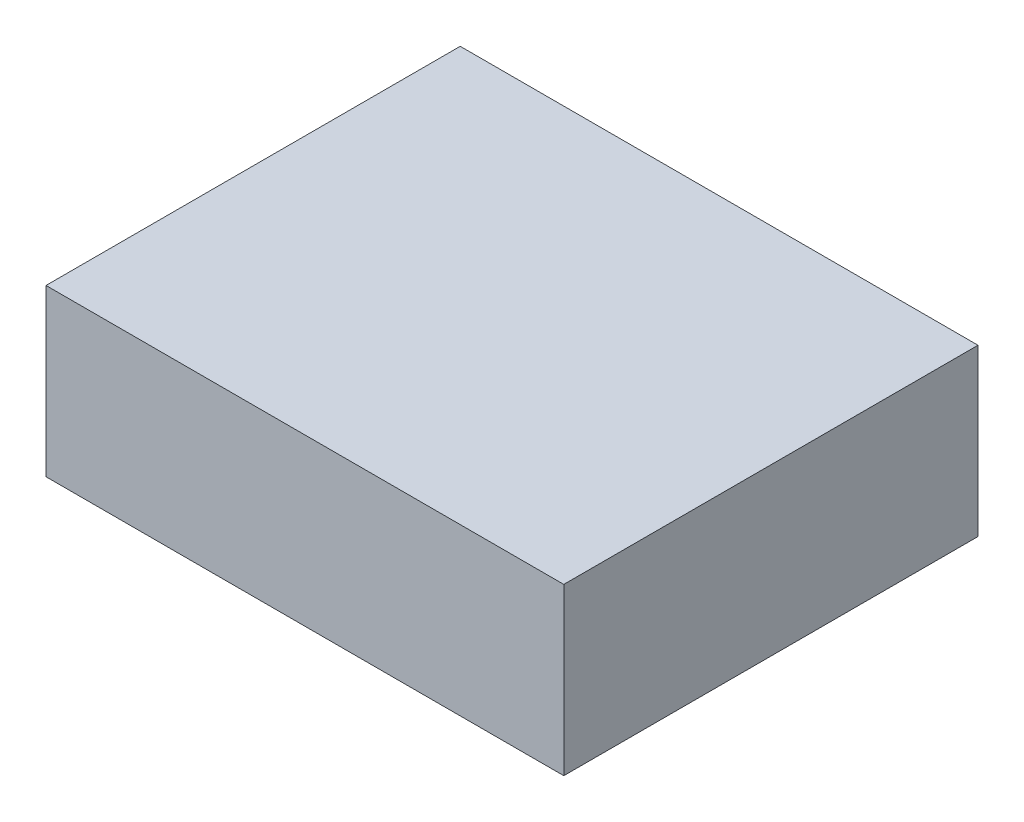
ISO-10303-21;
HEADER;
FILE_DESCRIPTION(('STEP AP214'),'2;1');
FILE_NAME('part.step','',(''),(''),'','','');
FILE_SCHEMA(('AUTOMOTIVE_DESIGN { 1 0 10303 214 1 1 1 1 }'));
ENDSEC;
DATA;
#1=APPLICATION_CONTEXT('core data for automotive mechanical design processes');
#2=APPLICATION_PROTOCOL_DEFINITION('international standard','automotive_design',2000,#1);
#3=PRODUCT_CONTEXT('',#1,'mechanical');
#4=PRODUCT('Part','Part','',(#3));
#5=PRODUCT_RELATED_PRODUCT_CATEGORY('part','',(#4));
#6=PRODUCT_DEFINITION_FORMATION('','',#4);
#7=PRODUCT_DEFINITION_CONTEXT('part definition',#1,'design');
#8=PRODUCT_DEFINITION('design','',#6,#7);
#9=PRODUCT_DEFINITION_SHAPE('','',#8);
#10=(LENGTH_UNIT() NAMED_UNIT(*) SI_UNIT(.MILLI.,.METRE.));
#11=(NAMED_UNIT(*) PLANE_ANGLE_UNIT() SI_UNIT($,.RADIAN.));
#12=(NAMED_UNIT(*) SI_UNIT($,.STERADIAN.) SOLID_ANGLE_UNIT());
#13=UNCERTAINTY_MEASURE_WITH_UNIT(LENGTH_MEASURE(1.E-05),#10,'distance_accuracy_value','');
#14=(GEOMETRIC_REPRESENTATION_CONTEXT(3) GLOBAL_UNCERTAINTY_ASSIGNED_CONTEXT((#13)) GLOBAL_UNIT_ASSIGNED_CONTEXT((#10,
#11,#12)) REPRESENTATION_CONTEXT('',''));
#15=CARTESIAN_POINT('',(0.,0.,0.));
#16=DIRECTION('',(0.,0.,1.));
#17=DIRECTION('',(1.,0.,0.));
#18=AXIS2_PLACEMENT_3D('',#15,#16,#17);
#19=CARTESIAN_POINT('',(5.675,-0.8,-8.375));
#20=DIRECTION('',(0.,1.,0.));
#21=DIRECTION('',(1.,0.,0.));
#22=AXIS2_PLACEMENT_3D('',#19,#20,#21);
#23=PLANE('',#22);
#24=DIRECTION('',(0.,0.,1.));
#25=VECTOR('',#24,1.);
#26=CARTESIAN_POINT('',(10.675,-0.8,-10.375));
#27=LINE('',#26,#25);
#28=CARTESIAN_POINT('',(10.675,-0.8,-12.375));
#29=VERTEX_POINT('',#28);
#30=CARTESIAN_POINT('',(10.675,-0.8,-8.375));
#31=VERTEX_POINT('',#30);
#32=EDGE_CURVE('E54',#29,#31,#27,.T.);
#33=ORIENTED_EDGE('',*,*,#32,.F.);
#34=DIRECTION('',(1.,0.,0.));
#35=VECTOR('',#34,1.);
#36=CARTESIAN_POINT('',(8.175,-0.8,-12.375));
#37=LINE('',#36,#35);
#38=CARTESIAN_POINT('',(5.675,-0.8,-12.375));
#39=VERTEX_POINT('',#38);
#40=EDGE_CURVE('E69',#39,#29,#37,.T.);
#41=ORIENTED_EDGE('',*,*,#40,.F.);
#42=DIRECTION('',(0.,0.,-1.));
#43=VECTOR('',#42,1.);
#44=CARTESIAN_POINT('',(5.675,-0.8,-10.375));
#45=LINE('',#44,#43);
#46=CARTESIAN_POINT('',(5.675,-0.8,-8.375));
#47=VERTEX_POINT('',#46);
#48=EDGE_CURVE('E21',#47,#39,#45,.T.);
#49=ORIENTED_EDGE('',*,*,#48,.F.);
#50=DIRECTION('',(-1.,0.,0.));
#51=VECTOR('',#50,1.);
#52=CARTESIAN_POINT('',(8.175,-0.8,-8.375));
#53=LINE('',#52,#51);
#54=EDGE_CURVE('E59',#31,#47,#53,.T.);
#55=ORIENTED_EDGE('',*,*,#54,.F.);
#56=EDGE_LOOP('',(#33,#41,#49,#55));
#57=FACE_BOUND('',#56,.T.);
#58=ADVANCED_FACE('F17',(#57),#23,.T.);
#59=CARTESIAN_POINT('',(5.675,-2.4,-12.375));
#60=DIRECTION('',(-1.,0.,0.));
#61=DIRECTION('',(0.,0.,1.));
#62=AXIS2_PLACEMENT_3D('',#59,#60,#61);
#63=PLANE('',#62);
#64=ORIENTED_EDGE('',*,*,#48,.T.);
#65=DIRECTION('',(0.,1.,0.));
#66=VECTOR('',#65,1.);
#67=CARTESIAN_POINT('',(5.675,-1.6,-12.375));
#68=LINE('',#67,#66);
#69=CARTESIAN_POINT('',(5.675,-2.4,-12.375));
#70=VERTEX_POINT('',#69);
#71=EDGE_CURVE('E80',#70,#39,#68,.T.);
#72=ORIENTED_EDGE('',*,*,#71,.F.);
#73=DIRECTION('',(0.,0.,1.));
#74=VECTOR('',#73,1.);
#75=CARTESIAN_POINT('',(5.675,-2.4,-10.375));
#76=LINE('',#75,#74);
#77=CARTESIAN_POINT('',(5.675,-2.4,-8.375));
#78=VERTEX_POINT('',#77);
#79=EDGE_CURVE('E75',#70,#78,#76,.T.);
#80=ORIENTED_EDGE('',*,*,#79,.T.);
#81=DIRECTION('',(0.,-1.,0.));
#82=VECTOR('',#81,1.);
#83=CARTESIAN_POINT('',(5.675,-1.6,-8.375));
#84=LINE('',#83,#82);
#85=EDGE_CURVE('E64',#47,#78,#84,.T.);
#86=ORIENTED_EDGE('',*,*,#85,.F.);
#87=EDGE_LOOP('',(#64,#72,#80,#86));
#88=FACE_BOUND('',#87,.T.);
#89=ADVANCED_FACE('F74',(#88),#63,.T.);
#90=CARTESIAN_POINT('',(5.675,-2.4,-8.375));
#91=DIRECTION('',(0.,0.,1.));
#92=DIRECTION('',(1.,0.,0.));
#93=AXIS2_PLACEMENT_3D('',#90,#91,#92);
#94=PLANE('',#93);
#95=ORIENTED_EDGE('',*,*,#54,.T.);
#96=ORIENTED_EDGE('',*,*,#85,.T.);
#97=DIRECTION('',(1.,0.,0.));
#98=VECTOR('',#97,1.);
#99=CARTESIAN_POINT('',(8.175,-2.4,-8.375));
#100=LINE('',#99,#98);
#101=CARTESIAN_POINT('',(10.675,-2.4,-8.375));
#102=VERTEX_POINT('',#101);
#103=EDGE_CURVE('E85',#78,#102,#100,.T.);
#104=ORIENTED_EDGE('',*,*,#103,.T.);
#105=DIRECTION('',(0.,-1.,0.));
#106=VECTOR('',#105,1.);
#107=CARTESIAN_POINT('',(10.675,-1.6,-8.375));
#108=LINE('',#107,#106);
#109=EDGE_CURVE('E66',#31,#102,#108,.T.);
#110=ORIENTED_EDGE('',*,*,#109,.F.);
#111=EDGE_LOOP('',(#95,#96,#104,#110));
#112=FACE_BOUND('',#111,.T.);
#113=ADVANCED_FACE('F61',(#112),#94,.T.);
#114=CARTESIAN_POINT('',(10.675,-2.4,-8.375));
#115=DIRECTION('',(1.,0.,0.));
#116=DIRECTION('',(0.,0.,-1.));
#117=AXIS2_PLACEMENT_3D('',#114,#115,#116);
#118=PLANE('',#117);
#119=ORIENTED_EDGE('',*,*,#32,.T.);
#120=ORIENTED_EDGE('',*,*,#109,.T.);
#121=DIRECTION('',(0.,0.,-1.));
#122=VECTOR('',#121,1.);
#123=CARTESIAN_POINT('',(10.675,-2.4,-10.375));
#124=LINE('',#123,#122);
#125=CARTESIAN_POINT('',(10.675,-2.4,-12.375));
#126=VERTEX_POINT('',#125);
#127=EDGE_CURVE('E27',#102,#126,#124,.T.);
#128=ORIENTED_EDGE('',*,*,#127,.T.);
#129=DIRECTION('',(0.,-1.,0.));
#130=VECTOR('',#129,1.);
#131=CARTESIAN_POINT('',(10.675,-1.6,-12.375));
#132=LINE('',#131,#130);
#133=EDGE_CURVE('E35',#29,#126,#132,.T.);
#134=ORIENTED_EDGE('',*,*,#133,.F.);
#135=EDGE_LOOP('',(#119,#120,#128,#134));
#136=FACE_BOUND('',#135,.T.);
#137=ADVANCED_FACE('F89',(#136),#118,.T.);
#138=CARTESIAN_POINT('',(10.675,-2.4,-12.375));
#139=DIRECTION('',(0.,0.,-1.));
#140=DIRECTION('',(-1.,0.,0.));
#141=AXIS2_PLACEMENT_3D('',#138,#139,#140);
#142=PLANE('',#141);
#143=ORIENTED_EDGE('',*,*,#40,.T.);
#144=ORIENTED_EDGE('',*,*,#133,.T.);
#145=DIRECTION('',(-1.,0.,0.));
#146=VECTOR('',#145,1.);
#147=CARTESIAN_POINT('',(8.175,-2.4,-12.375));
#148=LINE('',#147,#146);
#149=EDGE_CURVE('E11',#126,#70,#148,.T.);
#150=ORIENTED_EDGE('',*,*,#149,.T.);
#151=ORIENTED_EDGE('',*,*,#71,.T.);
#152=EDGE_LOOP('',(#143,#144,#150,#151));
#153=FACE_BOUND('',#152,.T.);
#154=ADVANCED_FACE('F91',(#153),#142,.T.);
#155=CARTESIAN_POINT('',(5.675,-2.4,-8.375));
#156=DIRECTION('',(0.,1.,0.));
#157=DIRECTION('',(1.,0.,0.));
#158=AXIS2_PLACEMENT_3D('',#155,#156,#157);
#159=PLANE('',#158);
#160=ORIENTED_EDGE('',*,*,#127,.F.);
#161=ORIENTED_EDGE('',*,*,#103,.F.);
#162=ORIENTED_EDGE('',*,*,#79,.F.);
#163=ORIENTED_EDGE('',*,*,#149,.F.);
#164=EDGE_LOOP('',(#160,#161,#162,#163));
#165=FACE_BOUND('',#164,.T.);
#166=ADVANCED_FACE('F19',(#165),#159,.F.);
#167=CLOSED_SHELL('',(#58,#89,#113,#137,#154,#166));
#168=MANIFOLD_SOLID_BREP('B1',#167);
#169=ADVANCED_BREP_SHAPE_REPRESENTATION('',(#18,#168),#14);
#170=SHAPE_DEFINITION_REPRESENTATION(#9,#169);
ENDSEC;
END-ISO-10303-21;
